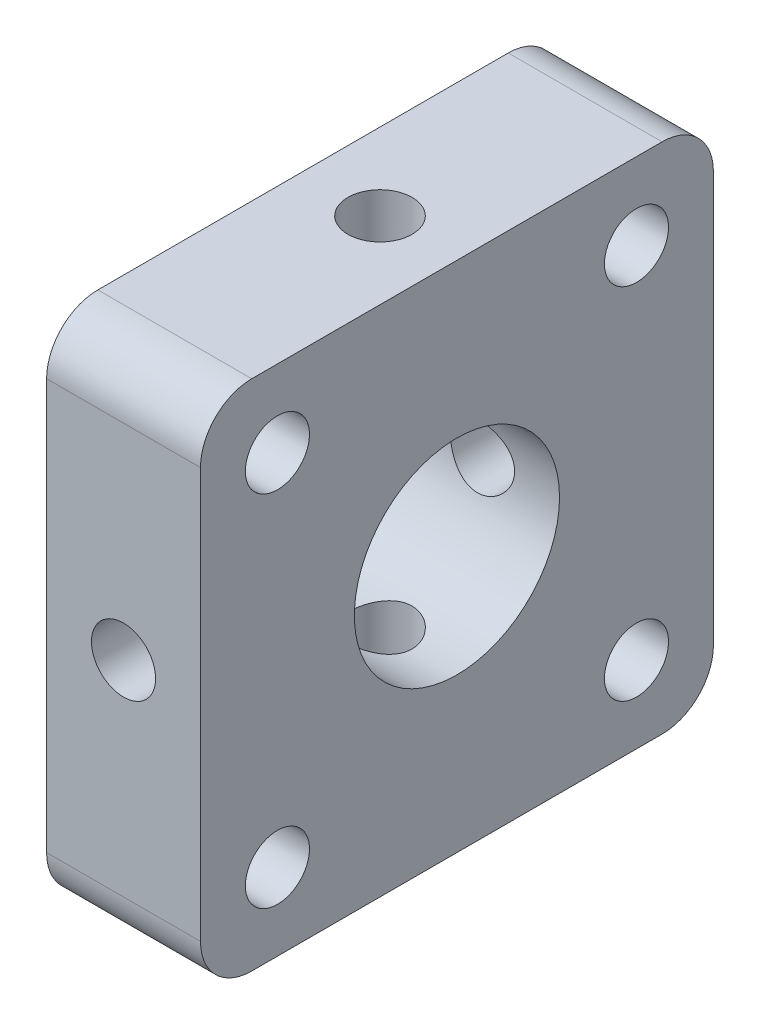
ISO-10303-21;
HEADER;
FILE_DESCRIPTION(('STEP AP214'),'2;1');
FILE_NAME('part.step','',(''),(''),'','','');
FILE_SCHEMA(('AUTOMOTIVE_DESIGN { 1 0 10303 214 1 1 1 1 }'));
ENDSEC;
DATA;
#1=APPLICATION_CONTEXT('core data for automotive mechanical design processes');
#2=APPLICATION_PROTOCOL_DEFINITION('international standard','automotive_design',2000,#1);
#3=PRODUCT_CONTEXT('',#1,'mechanical');
#4=PRODUCT('Part','Part','',(#3));
#5=PRODUCT_RELATED_PRODUCT_CATEGORY('part','',(#4));
#6=PRODUCT_DEFINITION_FORMATION('','',#4);
#7=PRODUCT_DEFINITION_CONTEXT('part definition',#1,'design');
#8=PRODUCT_DEFINITION('design','',#6,#7);
#9=PRODUCT_DEFINITION_SHAPE('','',#8);
#10=(LENGTH_UNIT() NAMED_UNIT(*) SI_UNIT(.MILLI.,.METRE.));
#11=(NAMED_UNIT(*) PLANE_ANGLE_UNIT() SI_UNIT($,.RADIAN.));
#12=(NAMED_UNIT(*) SI_UNIT($,.STERADIAN.) SOLID_ANGLE_UNIT());
#13=UNCERTAINTY_MEASURE_WITH_UNIT(LENGTH_MEASURE(1.E-05),#10,'distance_accuracy_value','');
#14=(GEOMETRIC_REPRESENTATION_CONTEXT(3) GLOBAL_UNCERTAINTY_ASSIGNED_CONTEXT((#13)) GLOBAL_UNIT_ASSIGNED_CONTEXT((#10,
#11,#12)) REPRESENTATION_CONTEXT('',''));
#15=CARTESIAN_POINT('',(0.,0.,0.));
#16=DIRECTION('',(0.,0.,1.));
#17=DIRECTION('',(1.,0.,0.));
#18=AXIS2_PLACEMENT_3D('',#15,#16,#17);
#19=CARTESIAN_POINT('',(0.,0.,0.));
#20=DIRECTION('',(1.,0.,0.));
#21=DIRECTION('',(0.,0.,-1.));
#22=AXIS2_PLACEMENT_3D('',#19,#20,#21);
#23=PLANE('',#22);
#24=CARTESIAN_POINT('',(0.,-7.00000000000001,7.));
#25=DIRECTION('',(-1.,0.,0.));
#26=DIRECTION('',(0.,0.,1.));
#27=AXIS2_PLACEMENT_3D('',#24,#25,#26);
#28=CIRCLE('',#27,1.24999999999999);
#29=CARTESIAN_POINT('',(0.,-7.00000000000001,8.24999999999999));
#30=VERTEX_POINT('',#29);
#31=EDGE_CURVE('E270',#30,#30,#28,.T.);
#32=ORIENTED_EDGE('',*,*,#31,.F.);
#33=EDGE_LOOP('',(#32));
#34=FACE_BOUND('',#33,.T.);
#35=DIRECTION('',(0.,0.,-1.));
#36=VECTOR('',#35,1.);
#37=CARTESIAN_POINT('',(0.,-10.,-10.));
#38=LINE('',#37,#36);
#39=CARTESIAN_POINT('',(0.,-10.,8.));
#40=VERTEX_POINT('',#39);
#41=CARTESIAN_POINT('',(0.,-10.,-8.));
#42=VERTEX_POINT('',#41);
#43=EDGE_CURVE('E128',#40,#42,#38,.T.);
#44=ORIENTED_EDGE('',*,*,#43,.F.);
#45=CARTESIAN_POINT('',(0.,-8.,8.));
#46=DIRECTION('',(1.,0.,0.));
#47=DIRECTION('',(0.,0.,-1.));
#48=AXIS2_PLACEMENT_3D('',#45,#46,#47);
#49=CIRCLE('',#48,2.);
#50=CARTESIAN_POINT('',(0.,-8.,10.));
#51=VERTEX_POINT('',#50);
#52=EDGE_CURVE('E110',#40,#51,#49,.F.);
#53=ORIENTED_EDGE('',*,*,#52,.T.);
#54=DIRECTION('',(0.,-1.,0.));
#55=VECTOR('',#54,1.);
#56=CARTESIAN_POINT('',(0.,-10.,10.));
#57=LINE('',#56,#55);
#58=CARTESIAN_POINT('',(0.,8.,10.));
#59=VERTEX_POINT('',#58);
#60=EDGE_CURVE('E140',#59,#51,#57,.T.);
#61=ORIENTED_EDGE('',*,*,#60,.F.);
#62=CARTESIAN_POINT('',(0.,8.,8.));
#63=DIRECTION('',(1.,0.,0.));
#64=DIRECTION('',(0.,0.,-1.));
#65=AXIS2_PLACEMENT_3D('',#62,#63,#64);
#66=CIRCLE('',#65,2.);
#67=CARTESIAN_POINT('',(0.,10.,8.));
#68=VERTEX_POINT('',#67);
#69=EDGE_CURVE('E203',#59,#68,#66,.F.);
#70=ORIENTED_EDGE('',*,*,#69,.T.);
#71=DIRECTION('',(0.,0.,1.));
#72=VECTOR('',#71,1.);
#73=CARTESIAN_POINT('',(0.,10.,-10.));
#74=LINE('',#73,#72);
#75=CARTESIAN_POINT('',(0.,10.,-8.));
#76=VERTEX_POINT('',#75);
#77=EDGE_CURVE('E145',#76,#68,#74,.T.);
#78=ORIENTED_EDGE('',*,*,#77,.F.);
#79=CARTESIAN_POINT('',(0.,8.,-8.));
#80=DIRECTION('',(1.,0.,0.));
#81=DIRECTION('',(0.,0.,-1.));
#82=AXIS2_PLACEMENT_3D('',#79,#80,#81);
#83=CIRCLE('',#82,2.);
#84=CARTESIAN_POINT('',(0.,8.,-10.));
#85=VERTEX_POINT('',#84);
#86=EDGE_CURVE('E133',#76,#85,#83,.F.);
#87=ORIENTED_EDGE('',*,*,#86,.T.);
#88=DIRECTION('',(0.,1.,0.));
#89=VECTOR('',#88,1.);
#90=CARTESIAN_POINT('',(0.,-10.,-10.));
#91=LINE('',#90,#89);
#92=CARTESIAN_POINT('',(0.,-8.,-10.));
#93=VERTEX_POINT('',#92);
#94=EDGE_CURVE('E139',#93,#85,#91,.T.);
#95=ORIENTED_EDGE('',*,*,#94,.F.);
#96=CARTESIAN_POINT('',(0.,-8.,-8.));
#97=DIRECTION('',(1.,0.,0.));
#98=DIRECTION('',(0.,0.,-1.));
#99=AXIS2_PLACEMENT_3D('',#96,#97,#98);
#100=CIRCLE('',#99,2.);
#101=EDGE_CURVE('E122',#93,#42,#100,.F.);
#102=ORIENTED_EDGE('',*,*,#101,.T.);
#103=EDGE_LOOP('',(#44,#53,#61,#70,#78,#87,#95,#102));
#104=FACE_BOUND('',#103,.T.);
#105=CARTESIAN_POINT('',(0.,0.,0.));
#106=DIRECTION('',(1.,0.,0.));
#107=DIRECTION('',(0.,0.,-1.));
#108=AXIS2_PLACEMENT_3D('',#105,#106,#107);
#109=CIRCLE('',#108,4.);
#110=CARTESIAN_POINT('',(0.,0.,-4.));
#111=VERTEX_POINT('',#110);
#112=EDGE_CURVE('E252',#111,#111,#109,.T.);
#113=ORIENTED_EDGE('',*,*,#112,.T.);
#114=EDGE_LOOP('',(#113));
#115=FACE_BOUND('',#114,.T.);
#116=CARTESIAN_POINT('',(0.,-7.,-7.));
#117=DIRECTION('',(-1.,0.,0.));
#118=DIRECTION('',(0.,0.,1.));
#119=AXIS2_PLACEMENT_3D('',#116,#117,#118);
#120=CIRCLE('',#119,1.24999999999999);
#121=CARTESIAN_POINT('',(0.,-7.,-5.75000000000001));
#122=VERTEX_POINT('',#121);
#123=EDGE_CURVE('E554',#122,#122,#120,.T.);
#124=ORIENTED_EDGE('',*,*,#123,.F.);
#125=EDGE_LOOP('',(#124));
#126=FACE_BOUND('',#125,.T.);
#127=CARTESIAN_POINT('',(0.,7.,7.));
#128=DIRECTION('',(-1.,0.,0.));
#129=DIRECTION('',(0.,0.,1.));
#130=AXIS2_PLACEMENT_3D('',#127,#128,#129);
#131=CIRCLE('',#130,1.24999999999999);
#132=CARTESIAN_POINT('',(0.,7.,8.24999999999999));
#133=VERTEX_POINT('',#132);
#134=EDGE_CURVE('E546',#133,#133,#131,.T.);
#135=ORIENTED_EDGE('',*,*,#134,.F.);
#136=EDGE_LOOP('',(#135));
#137=FACE_BOUND('',#136,.T.);
#138=CARTESIAN_POINT('',(0.,7.,-7.));
#139=DIRECTION('',(-1.,0.,0.));
#140=DIRECTION('',(0.,0.,1.));
#141=AXIS2_PLACEMENT_3D('',#138,#139,#140);
#142=CIRCLE('',#141,1.24999999999999);
#143=CARTESIAN_POINT('',(0.,7.,-5.75000000000001));
#144=VERTEX_POINT('',#143);
#145=EDGE_CURVE('E541',#144,#144,#142,.T.);
#146=ORIENTED_EDGE('',*,*,#145,.F.);
#147=EDGE_LOOP('',(#146));
#148=FACE_BOUND('',#147,.T.);
#149=ADVANCED_FACE('F44',(#34,#104,#115,#126,#137,#148),#23,.F.);
#150=CARTESIAN_POINT('',(6.,0.,0.));
#151=DIRECTION('',(1.,0.,0.));
#152=DIRECTION('',(0.,0.,-1.));
#153=AXIS2_PLACEMENT_3D('',#150,#151,#152);
#154=PLANE('',#153);
#155=CARTESIAN_POINT('',(6.,7.,-7.));
#156=DIRECTION('',(-1.,0.,0.));
#157=DIRECTION('',(0.,0.,1.));
#158=AXIS2_PLACEMENT_3D('',#155,#156,#157);
#159=CIRCLE('',#158,1.25);
#160=CARTESIAN_POINT('',(6.,7.,-5.75));
#161=VERTEX_POINT('',#160);
#162=EDGE_CURVE('E538',#161,#161,#159,.T.);
#163=ORIENTED_EDGE('',*,*,#162,.T.);
#164=EDGE_LOOP('',(#163));
#165=FACE_BOUND('',#164,.T.);
#166=CARTESIAN_POINT('',(6.,7.,7.));
#167=DIRECTION('',(-1.,0.,0.));
#168=DIRECTION('',(0.,0.,1.));
#169=AXIS2_PLACEMENT_3D('',#166,#167,#168);
#170=CIRCLE('',#169,1.25);
#171=CARTESIAN_POINT('',(6.,7.,8.25));
#172=VERTEX_POINT('',#171);
#173=EDGE_CURVE('E551',#172,#172,#170,.T.);
#174=ORIENTED_EDGE('',*,*,#173,.T.);
#175=EDGE_LOOP('',(#174));
#176=FACE_BOUND('',#175,.T.);
#177=CARTESIAN_POINT('',(6.,-7.,-7.));
#178=DIRECTION('',(-1.,0.,0.));
#179=DIRECTION('',(0.,0.,1.));
#180=AXIS2_PLACEMENT_3D('',#177,#178,#179);
#181=CIRCLE('',#180,1.25);
#182=CARTESIAN_POINT('',(6.,-7.,-5.75));
#183=VERTEX_POINT('',#182);
#184=EDGE_CURVE('E278',#183,#183,#181,.T.);
#185=ORIENTED_EDGE('',*,*,#184,.T.);
#186=EDGE_LOOP('',(#185));
#187=FACE_BOUND('',#186,.T.);
#188=CARTESIAN_POINT('',(6.,0.,0.));
#189=DIRECTION('',(1.,0.,0.));
#190=DIRECTION('',(0.,0.,-1.));
#191=AXIS2_PLACEMENT_3D('',#188,#189,#190);
#192=CIRCLE('',#191,4.);
#193=CARTESIAN_POINT('',(6.,0.,-4.));
#194=VERTEX_POINT('',#193);
#195=EDGE_CURVE('E148',#194,#194,#192,.T.);
#196=ORIENTED_EDGE('',*,*,#195,.F.);
#197=EDGE_LOOP('',(#196));
#198=FACE_BOUND('',#197,.T.);
#199=DIRECTION('',(0.,-1.,0.));
#200=VECTOR('',#199,1.);
#201=CARTESIAN_POINT('',(6.,-10.,10.));
#202=LINE('',#201,#200);
#203=CARTESIAN_POINT('',(6.,8.,10.));
#204=VERTEX_POINT('',#203);
#205=CARTESIAN_POINT('',(6.,-8.,10.));
#206=VERTEX_POINT('',#205);
#207=EDGE_CURVE('E154',#204,#206,#202,.T.);
#208=ORIENTED_EDGE('',*,*,#207,.T.);
#209=CARTESIAN_POINT('',(6.,-8.,8.));
#210=DIRECTION('',(1.,0.,0.));
#211=DIRECTION('',(0.,0.,-1.));
#212=AXIS2_PLACEMENT_3D('',#209,#210,#211);
#213=CIRCLE('',#212,2.);
#214=CARTESIAN_POINT('',(6.,-10.,8.));
#215=VERTEX_POINT('',#214);
#216=EDGE_CURVE('E221',#206,#215,#213,.T.);
#217=ORIENTED_EDGE('',*,*,#216,.T.);
#218=DIRECTION('',(0.,0.,-1.));
#219=VECTOR('',#218,1.);
#220=CARTESIAN_POINT('',(6.,-10.,-10.));
#221=LINE('',#220,#219);
#222=CARTESIAN_POINT('',(6.,-10.,-8.));
#223=VERTEX_POINT('',#222);
#224=EDGE_CURVE('E131',#215,#223,#221,.T.);
#225=ORIENTED_EDGE('',*,*,#224,.T.);
#226=CARTESIAN_POINT('',(6.,-8.,-8.));
#227=DIRECTION('',(1.,0.,0.));
#228=DIRECTION('',(0.,0.,-1.));
#229=AXIS2_PLACEMENT_3D('',#226,#227,#228);
#230=CIRCLE('',#229,2.);
#231=CARTESIAN_POINT('',(6.,-8.,-10.));
#232=VERTEX_POINT('',#231);
#233=EDGE_CURVE('E218',#223,#232,#230,.T.);
#234=ORIENTED_EDGE('',*,*,#233,.T.);
#235=DIRECTION('',(0.,1.,0.));
#236=VECTOR('',#235,1.);
#237=CARTESIAN_POINT('',(6.,-10.,-10.));
#238=LINE('',#237,#236);
#239=CARTESIAN_POINT('',(6.,8.,-10.));
#240=VERTEX_POINT('',#239);
#241=EDGE_CURVE('E249',#232,#240,#238,.T.);
#242=ORIENTED_EDGE('',*,*,#241,.T.);
#243=CARTESIAN_POINT('',(6.,8.,-8.));
#244=DIRECTION('',(1.,0.,0.));
#245=DIRECTION('',(0.,0.,-1.));
#246=AXIS2_PLACEMENT_3D('',#243,#244,#245);
#247=CIRCLE('',#246,2.);
#248=CARTESIAN_POINT('',(6.,10.,-8.));
#249=VERTEX_POINT('',#248);
#250=EDGE_CURVE('E65',#240,#249,#247,.T.);
#251=ORIENTED_EDGE('',*,*,#250,.T.);
#252=DIRECTION('',(0.,0.,1.));
#253=VECTOR('',#252,1.);
#254=CARTESIAN_POINT('',(6.,10.,-10.));
#255=LINE('',#254,#253);
#256=CARTESIAN_POINT('',(6.,10.,8.));
#257=VERTEX_POINT('',#256);
#258=EDGE_CURVE('E199',#249,#257,#255,.T.);
#259=ORIENTED_EDGE('',*,*,#258,.T.);
#260=CARTESIAN_POINT('',(6.,8.,8.));
#261=DIRECTION('',(1.,0.,0.));
#262=DIRECTION('',(0.,0.,-1.));
#263=AXIS2_PLACEMENT_3D('',#260,#261,#262);
#264=CIRCLE('',#263,2.);
#265=EDGE_CURVE('E215',#257,#204,#264,.T.);
#266=ORIENTED_EDGE('',*,*,#265,.T.);
#267=EDGE_LOOP('',(#208,#217,#225,#234,#242,#251,#259,#266));
#268=FACE_BOUND('',#267,.T.);
#269=CARTESIAN_POINT('',(6.,-7.00000000000001,7.));
#270=DIRECTION('',(-1.,0.,0.));
#271=DIRECTION('',(0.,0.,1.));
#272=AXIS2_PLACEMENT_3D('',#269,#270,#271);
#273=CIRCLE('',#272,1.25);
#274=CARTESIAN_POINT('',(6.,-7.00000000000001,8.25));
#275=VERTEX_POINT('',#274);
#276=EDGE_CURVE('E266',#275,#275,#273,.T.);
#277=ORIENTED_EDGE('',*,*,#276,.T.);
#278=EDGE_LOOP('',(#277));
#279=FACE_BOUND('',#278,.T.);
#280=ADVANCED_FACE('F260',(#165,#176,#187,#198,#268,#279),#154,.T.);
#281=CARTESIAN_POINT('',(6.,-10.,10.));
#282=DIRECTION('',(0.,0.,-1.));
#283=DIRECTION('',(-1.,0.,0.));
#284=AXIS2_PLACEMENT_3D('',#281,#282,#283);
#285=PLANE('',#284);
#286=CARTESIAN_POINT('',(3.,0.,10.));
#287=DIRECTION('',(0.,0.,-1.));
#288=DIRECTION('',(-1.,0.,0.));
#289=AXIS2_PLACEMENT_3D('',#286,#287,#288);
#290=CIRCLE('',#289,1.25);
#291=CARTESIAN_POINT('',(1.75000000000001,0.,10.));
#292=VERTEX_POINT('',#291);
#293=EDGE_CURVE('E274',#292,#292,#290,.T.);
#294=ORIENTED_EDGE('',*,*,#293,.T.);
#295=EDGE_LOOP('',(#294));
#296=FACE_BOUND('',#295,.T.);
#297=ORIENTED_EDGE('',*,*,#60,.T.);
#298=DIRECTION('',(-1.,0.,0.));
#299=VECTOR('',#298,1.);
#300=CARTESIAN_POINT('',(6.,-8.,10.));
#301=LINE('',#300,#299);
#302=EDGE_CURVE('E115',#51,#206,#301,.F.);
#303=ORIENTED_EDGE('',*,*,#302,.T.);
#304=ORIENTED_EDGE('',*,*,#207,.F.);
#305=DIRECTION('',(-1.,0.,0.));
#306=VECTOR('',#305,1.);
#307=CARTESIAN_POINT('',(6.,8.,10.));
#308=LINE('',#307,#306);
#309=EDGE_CURVE('E121',#204,#59,#308,.T.);
#310=ORIENTED_EDGE('',*,*,#309,.T.);
#311=EDGE_LOOP('',(#297,#303,#304,#310));
#312=FACE_BOUND('',#311,.T.);
#313=ADVANCED_FACE('F242',(#296,#312),#285,.F.);
#314=CARTESIAN_POINT('',(6.,-10.,-10.));
#315=DIRECTION('',(0.,1.,0.));
#316=DIRECTION('',(0.,0.,1.));
#317=AXIS2_PLACEMENT_3D('',#314,#315,#316);
#318=PLANE('',#317);
#319=CARTESIAN_POINT('',(3.,-10.,0.));
#320=DIRECTION('',(0.,1.,0.));
#321=DIRECTION('',(0.,0.,1.));
#322=AXIS2_PLACEMENT_3D('',#319,#320,#321);
#323=CIRCLE('',#322,1.25);
#324=CARTESIAN_POINT('',(3.,-10.,1.25));
#325=VERTEX_POINT('',#324);
#326=EDGE_CURVE('E164',#325,#325,#323,.T.);
#327=ORIENTED_EDGE('',*,*,#326,.T.);
#328=EDGE_LOOP('',(#327));
#329=FACE_BOUND('',#328,.T.);
#330=ORIENTED_EDGE('',*,*,#224,.F.);
#331=DIRECTION('',(-1.,0.,0.));
#332=VECTOR('',#331,1.);
#333=CARTESIAN_POINT('',(6.,-10.,8.));
#334=LINE('',#333,#332);
#335=EDGE_CURVE('E114',#215,#40,#334,.T.);
#336=ORIENTED_EDGE('',*,*,#335,.T.);
#337=ORIENTED_EDGE('',*,*,#43,.T.);
#338=DIRECTION('',(-1.,0.,0.));
#339=VECTOR('',#338,1.);
#340=CARTESIAN_POINT('',(6.,-10.,-8.));
#341=LINE('',#340,#339);
#342=EDGE_CURVE('E134',#42,#223,#341,.F.);
#343=ORIENTED_EDGE('',*,*,#342,.T.);
#344=EDGE_LOOP('',(#330,#336,#337,#343));
#345=FACE_BOUND('',#344,.T.);
#346=ADVANCED_FACE('F127',(#329,#345),#318,.F.);
#347=CARTESIAN_POINT('',(6.,-10.,-10.));
#348=DIRECTION('',(0.,0.,1.));
#349=DIRECTION('',(0.,-1.,0.));
#350=AXIS2_PLACEMENT_3D('',#347,#348,#349);
#351=PLANE('',#350);
#352=CARTESIAN_POINT('',(3.,0.,-10.));
#353=DIRECTION('',(0.,0.,-1.));
#354=DIRECTION('',(-1.,0.,0.));
#355=AXIS2_PLACEMENT_3D('',#352,#353,#354);
#356=CIRCLE('',#355,1.24999999999999);
#357=CARTESIAN_POINT('',(1.75000000000001,0.,-10.));
#358=VERTEX_POINT('',#357);
#359=EDGE_CURVE('E269',#358,#358,#356,.T.);
#360=ORIENTED_EDGE('',*,*,#359,.F.);
#361=EDGE_LOOP('',(#360));
#362=FACE_BOUND('',#361,.T.);
#363=ORIENTED_EDGE('',*,*,#241,.F.);
#364=DIRECTION('',(-1.,0.,0.));
#365=VECTOR('',#364,1.);
#366=CARTESIAN_POINT('',(6.,-8.,-10.));
#367=LINE('',#366,#365);
#368=EDGE_CURVE('E227',#232,#93,#367,.T.);
#369=ORIENTED_EDGE('',*,*,#368,.T.);
#370=ORIENTED_EDGE('',*,*,#94,.T.);
#371=DIRECTION('',(-1.,0.,0.));
#372=VECTOR('',#371,1.);
#373=CARTESIAN_POINT('',(6.,8.,-10.));
#374=LINE('',#373,#372);
#375=EDGE_CURVE('E224',#85,#240,#374,.F.);
#376=ORIENTED_EDGE('',*,*,#375,.T.);
#377=EDGE_LOOP('',(#363,#369,#370,#376));
#378=FACE_BOUND('',#377,.T.);
#379=ADVANCED_FACE('F314',(#362,#378),#351,.F.);
#380=CARTESIAN_POINT('',(6.,10.,-10.));
#381=DIRECTION('',(0.,-1.,0.));
#382=DIRECTION('',(0.,0.,-1.));
#383=AXIS2_PLACEMENT_3D('',#380,#381,#382);
#384=PLANE('',#383);
#385=CARTESIAN_POINT('',(3.,10.,0.));
#386=DIRECTION('',(0.,1.,0.));
#387=DIRECTION('',(0.,0.,1.));
#388=AXIS2_PLACEMENT_3D('',#385,#386,#387);
#389=CIRCLE('',#388,1.24999999999999);
#390=CARTESIAN_POINT('',(3.,10.,1.24999999999999));
#391=VERTEX_POINT('',#390);
#392=EDGE_CURVE('E197',#391,#391,#389,.T.);
#393=ORIENTED_EDGE('',*,*,#392,.F.);
#394=EDGE_LOOP('',(#393));
#395=FACE_BOUND('',#394,.T.);
#396=ORIENTED_EDGE('',*,*,#77,.T.);
#397=DIRECTION('',(-1.,0.,0.));
#398=VECTOR('',#397,1.);
#399=CARTESIAN_POINT('',(6.,10.,8.));
#400=LINE('',#399,#398);
#401=EDGE_CURVE('E11',#68,#257,#400,.F.);
#402=ORIENTED_EDGE('',*,*,#401,.T.);
#403=ORIENTED_EDGE('',*,*,#258,.F.);
#404=DIRECTION('',(-1.,0.,0.));
#405=VECTOR('',#404,1.);
#406=CARTESIAN_POINT('',(6.,10.,-8.));
#407=LINE('',#406,#405);
#408=EDGE_CURVE('E53',#249,#76,#407,.T.);
#409=ORIENTED_EDGE('',*,*,#408,.T.);
#410=EDGE_LOOP('',(#396,#402,#403,#409));
#411=FACE_BOUND('',#410,.T.);
#412=ADVANCED_FACE('F234',(#395,#411),#384,.F.);
#413=CARTESIAN_POINT('',(6.,0.,0.));
#414=DIRECTION('',(-1.,0.,0.));
#415=DIRECTION('',(0.,0.,1.));
#416=AXIS2_PLACEMENT_3D('',#413,#414,#415);
#417=CYLINDRICAL_SURFACE('',#416,4.);
#418=CARTESIAN_POINT('',(4.24999999999999,0.,4.));
#419=CARTESIAN_POINT('',(4.24999955341242,-0.068439185174546,3.99999965877989));
#420=CARTESIAN_POINT('',(4.24436077305554,-0.136883052502858,3.99822694984841));
#421=CARTESIAN_POINT('',(4.22201375846076,-0.271769209588447,3.99132894088807));
#422=CARTESIAN_POINT('',(4.20530301863563,-0.338211042725905,3.98620288199859));
#423=CARTESIAN_POINT('',(4.16143062880426,-0.467128543650803,3.97315815697909));
#424=CARTESIAN_POINT('',(4.13428515534703,-0.5296101769858,3.96524381499025));
#425=CARTESIAN_POINT('',(4.07038268232166,-0.649134802346456,3.94743969161093));
#426=CARTESIAN_POINT('',(4.03362416821941,-0.70617693544488,3.93754959899905));
#427=CARTESIAN_POINT('',(3.95034400798263,-0.814965334952276,3.91650213740282));
#428=CARTESIAN_POINT('',(3.90357911493892,-0.866520028156654,3.90531715926989));
#429=CARTESIAN_POINT('',(3.80213160758644,-0.961197382036988,3.88310046374208));
#430=CARTESIAN_POINT('',(3.74744752250545,-1.00431847289869,3.87206877523457));
#431=CARTESIAN_POINT('',(3.63005543619191,-1.08194336483113,3.85111144698172));
#432=CARTESIAN_POINT('',(3.56718252247277,-1.11620784150128,3.84121988301796));
#433=CARTESIAN_POINT('',(3.43620768501812,-1.17359741076671,3.82407801799234));
#434=CARTESIAN_POINT('',(3.36810714420607,-1.19672543771944,3.81682702128689));
#435=CARTESIAN_POINT('',(3.23077192254794,-1.23048459930033,3.80607606984501));
#436=CARTESIAN_POINT('',(3.16163315636115,-1.24147110007864,3.80246972929508));
#437=CARTESIAN_POINT('',(3.02240688108811,-1.25174555036987,3.7991005514095));
#438=CARTESIAN_POINT('',(2.95231962917834,-1.25103660995771,3.79933669227334));
#439=CARTESIAN_POINT('',(2.81612553973102,-1.23821824732738,3.80353189075438));
#440=CARTESIAN_POINT('',(2.74997087413844,-1.22656057869382,3.80734341745949));
#441=CARTESIAN_POINT('',(2.62060784346266,-1.19290813355625,3.81802025652489));
#442=CARTESIAN_POINT('',(2.5573997922912,-1.1709122584455,3.82488589343115));
#443=CARTESIAN_POINT('',(2.43464805556737,-1.11688874681277,3.84101044014297));
#444=CARTESIAN_POINT('',(2.37517138930802,-1.08471925662081,3.85030284660824));
#445=CARTESIAN_POINT('',(2.26231223212088,-1.01136020737847,3.8702185658007));
#446=CARTESIAN_POINT('',(2.20893132974629,-0.970168305215766,3.88084222394551));
#447=CARTESIAN_POINT('',(2.10722505658302,-0.877716954182118,3.90281527800493));
#448=CARTESIAN_POINT('',(2.05924044222032,-0.826084570592812,3.91417569605696));
#449=CARTESIAN_POINT('',(1.97252810642033,-0.715364408095526,3.9359157075958));
#450=CARTESIAN_POINT('',(1.9338010707808,-0.656276077349016,3.94629522838372));
#451=CARTESIAN_POINT('',(1.86647231139873,-0.531664610465451,3.96501294890191));
#452=CARTESIAN_POINT('',(1.83795186453604,-0.466094906919277,3.97333460648208));
#453=CARTESIAN_POINT('',(1.79244699914844,-0.330767977782642,3.98687955828554));
#454=CARTESIAN_POINT('',(1.77545907776161,-0.261012030724607,3.99210379325151));
#455=CARTESIAN_POINT('',(1.75408195742103,-0.122185157290344,3.99871389395014));
#456=CARTESIAN_POINT('',(1.74923145640649,-0.0531918487888419,4.00024022895439));
#457=CARTESIAN_POINT('',(1.75096622663734,0.0846303057325843,3.99969799730981));
#458=CARTESIAN_POINT('',(1.75754982732261,0.153459174306504,3.99762995581124));
#459=CARTESIAN_POINT('',(1.7815955926064,0.28721933297585,3.99022363769771));
#460=CARTESIAN_POINT('',(1.79878326761252,0.352204978420945,3.98496793110724));
#461=CARTESIAN_POINT('',(1.8432143523667,0.478351928861362,3.97180121379252));
#462=CARTESIAN_POINT('',(1.87045900402491,0.539512760449012,3.96388987514203));
#463=CARTESIAN_POINT('',(1.9349732165488,0.657932406672227,3.94598542759568));
#464=CARTESIAN_POINT('',(1.97247098749723,0.71505973978795,3.9359462681821));
#465=CARTESIAN_POINT('',(2.05615321011702,0.822365850960089,3.91493410002887));
#466=CARTESIAN_POINT('',(2.10234001774312,0.87254273804333,3.90396083845862));
#467=CARTESIAN_POINT('',(2.20425889005369,0.96658746291965,3.88176994885247));
#468=CARTESIAN_POINT('',(2.26029666374526,1.01012652339773,3.87055986714446));
#469=CARTESIAN_POINT('',(2.37912661637074,1.08721250244908,3.84961947087602));
#470=CARTESIAN_POINT('',(2.44191868800444,1.12075957972523,3.839889132814));
#471=CARTESIAN_POINT('',(2.57234517288586,1.1767008348114,3.82311782360754));
#472=CARTESIAN_POINT('',(2.6399596495047,1.19913819558885,3.81606646468027));
#473=CARTESIAN_POINT('',(2.7782724933238,1.23222894320963,3.80551170941212));
#474=CARTESIAN_POINT('',(2.84896967637132,1.24288681414609,3.80200696302675));
#475=CARTESIAN_POINT('',(2.98800408755424,1.25179406157539,3.79908292712495));
#476=CARTESIAN_POINT('',(3.05630345381293,1.25058279621956,3.79948604683077));
#477=CARTESIAN_POINT('',(3.19167458491918,1.23708818129473,3.80390090472383));
#478=CARTESIAN_POINT('',(3.258746406884,1.22480534822558,3.80791247457319));
#479=CARTESIAN_POINT('',(3.38879403960178,1.18987729913377,3.81896814158112));
#480=CARTESIAN_POINT('',(3.45181544109601,1.16738642405943,3.82596698183474));
#481=CARTESIAN_POINT('',(3.57324041353135,1.11280227335063,3.84219704261348));
#482=CARTESIAN_POINT('',(3.63164304207768,1.08070704444253,3.85142871716522));
#483=CARTESIAN_POINT('',(3.74464597044056,1.00635675013474,3.8715348703158));
#484=CARTESIAN_POINT('',(3.79900812950044,0.963753335241265,3.88245948922441));
#485=CARTESIAN_POINT('',(3.89998632811179,0.87020899640484,3.90448998821726));
#486=CARTESIAN_POINT('',(3.946600288991,0.819265842344395,3.91559591606795));
#487=CARTESIAN_POINT('',(4.03228253836298,0.708486662823325,3.93717271952329));
#488=CARTESIAN_POINT('',(4.07105473644996,0.648414574487373,3.94761101730634));
#489=CARTESIAN_POINT('',(4.13789891513943,0.522279138013647,3.96626769296916));
#490=CARTESIAN_POINT('',(4.16597510214182,0.456218157795443,3.97448694315832));
#491=CARTESIAN_POINT('',(4.20859136760846,0.325747635373973,3.98720650733461));
#492=CARTESIAN_POINT('',(4.22407486730533,0.261670337112542,3.99196240806139));
#493=CARTESIAN_POINT('',(4.24477835996771,0.131729895440246,3.99835900340486));
#494=CARTESIAN_POINT('',(4.25000042980399,0.0658671161396739,4.00000032839644));
#495=CARTESIAN_POINT('',(4.24999999999999,0.,4.));
#496=B_SPLINE_CURVE_WITH_KNOTS('',3,(#418,#419,#420,#421,#422,#423,#424,#425,#426,#427,#428,
#429,#430,#431,#432,#433,#434,#435,#436,#437,#438,#439,#440,#441,#442,#443,#444,#445,#446,#447,
#448,#449,#450,#451,#452,#453,#454,#455,#456,#457,#458,#459,#460,#461,#462,#463,#464,#465,#466,
#467,#468,#469,#470,#471,#472,#473,#474,#475,#476,#477,#478,#479,#480,#481,#482,#483,#484,#485,
#486,#487,#488,#489,#490,#491,#492,#493,#494,#495),.UNSPECIFIED.,.T.,.F.,(4,2,2,2,2,2,2,2,2,2,2,
2,2,2,2,2,2,2,2,2,2,2,2,2,2,2,2,2,2,2,2,2,2,2,2,2,2,2,4),(0.,0.205075449432509,
0.410197323349064,0.615002479202432,0.819839921558386,1.03037822195158,1.24095567431275,
1.45673771247493,1.67246286279526,1.88169150167209,2.09086450295137,2.29176917422168,
2.49269519979061,2.69655642720543,2.90047066010357,3.11366747279598,3.32688007413301,
3.54175460689768,3.75656384494551,3.96307568548235,4.1695573564936,4.37090626722869,
4.57228005034497,4.7785632473834,4.98490245709256,5.19941778713136,5.41392970983709,
5.62760115751027,5.84119123892427,6.0451220347605,6.24904331751081,6.44997913396667,
6.65095584330169,6.85979514006357,7.06869037373336,7.28440668126408,7.50003806666332,
7.69744636651536,7.89481470763042),.UNSPECIFIED.);
#497=CARTESIAN_POINT('',(4.24999999999999,0.,4.));
#498=VERTEX_POINT('',#497);
#499=EDGE_CURVE('E191',#498,#498,#496,.T.);
#500=ORIENTED_EDGE('',*,*,#499,.F.);
#501=EDGE_LOOP('',(#500));
#502=FACE_BOUND('',#501,.T.);
#503=CARTESIAN_POINT('',(1.75000000000001,0.,-4.));
#504=CARTESIAN_POINT('',(1.75000044658758,-0.0684391851745469,-3.99999965877989));
#505=CARTESIAN_POINT('',(1.75563922694446,-0.136883052502859,-3.99822694984841));
#506=CARTESIAN_POINT('',(1.77798624153924,-0.271769209588447,-3.99132894088807));
#507=CARTESIAN_POINT('',(1.79469698136437,-0.338211042725906,-3.9862028819986));
#508=CARTESIAN_POINT('',(1.83856937119575,-0.467128543650804,-3.9731581569791));
#509=CARTESIAN_POINT('',(1.86571484465297,-0.529610176985801,-3.96524381499025));
#510=CARTESIAN_POINT('',(1.92961731767834,-0.649134802346456,-3.94743969161093));
#511=CARTESIAN_POINT('',(1.96637583178059,-0.706176935444881,-3.93754959899905));
#512=CARTESIAN_POINT('',(2.04965599201737,-0.814965334952276,-3.91650213740283));
#513=CARTESIAN_POINT('',(2.09642088506108,-0.866520028156655,-3.90531715926989));
#514=CARTESIAN_POINT('',(2.19786839241356,-0.961197382036988,-3.88310046374209));
#515=CARTESIAN_POINT('',(2.25255247749455,-1.00431847289869,-3.87206877523458));
#516=CARTESIAN_POINT('',(2.36994456380809,-1.08194336483113,-3.85111144698173));
#517=CARTESIAN_POINT('',(2.43281747752723,-1.11620784150128,-3.84121988301796));
#518=CARTESIAN_POINT('',(2.56379231498188,-1.17359741076671,-3.82407801799235));
#519=CARTESIAN_POINT('',(2.63189285579393,-1.19672543771944,-3.81682702128689));
#520=CARTESIAN_POINT('',(2.76922807745206,-1.23048459930033,-3.80607606984501));
#521=CARTESIAN_POINT('',(2.83836684363885,-1.24147110007864,-3.80246972929509));
#522=CARTESIAN_POINT('',(2.97759311891189,-1.25174555036987,-3.79910055140951));
#523=CARTESIAN_POINT('',(3.04768037082166,-1.25103660995771,-3.79933669227335));
#524=CARTESIAN_POINT('',(3.18387446026898,-1.23821824732738,-3.80353189075438));
#525=CARTESIAN_POINT('',(3.25002912586156,-1.22656057869382,-3.80734341745949));
#526=CARTESIAN_POINT('',(3.37939215653734,-1.19290813355625,-3.81802025652489));
#527=CARTESIAN_POINT('',(3.4426002077088,-1.1709122584455,-3.82488589343115));
#528=CARTESIAN_POINT('',(3.56535194443263,-1.11688874681276,-3.84101044014297));
#529=CARTESIAN_POINT('',(3.62482861069198,-1.08471925662081,-3.85030284660825));
#530=CARTESIAN_POINT('',(3.73768776787912,-1.01136020737847,-3.8702185658007));
#531=CARTESIAN_POINT('',(3.79106867025371,-0.970168305215766,-3.88084222394551));
#532=CARTESIAN_POINT('',(3.89277494341698,-0.877716954182117,-3.90281527800493));
#533=CARTESIAN_POINT('',(3.94075955777968,-0.826084570592811,-3.91417569605696));
#534=CARTESIAN_POINT('',(4.02747189357967,-0.715364408095526,-3.9359157075958));
#535=CARTESIAN_POINT('',(4.0661989292192,-0.656276077349016,-3.94629522838373));
#536=CARTESIAN_POINT('',(4.13352768860127,-0.53166461046545,-3.96501294890191));
#537=CARTESIAN_POINT('',(4.16204813546396,-0.466094906919276,-3.97333460648208));
#538=CARTESIAN_POINT('',(4.20755300085156,-0.330767977782641,-3.98687955828554));
#539=CARTESIAN_POINT('',(4.22454092223839,-0.261012030724606,-3.99210379325152));
#540=CARTESIAN_POINT('',(4.24591804257897,-0.122185157290343,-3.99871389395014));
#541=CARTESIAN_POINT('',(4.25076854359351,-0.0531918487888414,-4.00024022895439));
#542=CARTESIAN_POINT('',(4.24903377336266,0.0846303057325847,-3.99969799730981));
#543=CARTESIAN_POINT('',(4.24245017267739,0.153459174306505,-3.99762995581125));
#544=CARTESIAN_POINT('',(4.2184044073936,0.287219332975851,-3.99022363769772));
#545=CARTESIAN_POINT('',(4.20121673238747,0.352204978420946,-3.98496793110725));
#546=CARTESIAN_POINT('',(4.1567856476333,0.478351928861363,-3.97180121379252));
#547=CARTESIAN_POINT('',(4.12954099597509,0.539512760449013,-3.96388987514204));
#548=CARTESIAN_POINT('',(4.0650267834512,0.657932406672228,-3.94598542759568));
#549=CARTESIAN_POINT('',(4.02752901250277,0.715059739787951,-3.9359462681821));
#550=CARTESIAN_POINT('',(3.94384678988298,0.822365850960091,-3.91493410002887));
#551=CARTESIAN_POINT('',(3.89765998225688,0.872542738043331,-3.90396083845862));
#552=CARTESIAN_POINT('',(3.79574110994631,0.96658746291965,-3.88176994885248));
#553=CARTESIAN_POINT('',(3.73970333625474,1.01012652339773,-3.87055986714446));
#554=CARTESIAN_POINT('',(3.62087338362926,1.08721250244908,-3.84961947087602));
#555=CARTESIAN_POINT('',(3.55808131199556,1.12075957972523,-3.839889132814));
#556=CARTESIAN_POINT('',(3.42765482711414,1.1767008348114,-3.82311782360754));
#557=CARTESIAN_POINT('',(3.3600403504953,1.19913819558885,-3.81606646468027));
#558=CARTESIAN_POINT('',(3.2217275066762,1.23222894320963,-3.80551170941213));
#559=CARTESIAN_POINT('',(3.15103032362868,1.24288681414609,-3.80200696302675));
#560=CARTESIAN_POINT('',(3.01199591244576,1.25179406157539,-3.79908292712495));
#561=CARTESIAN_POINT('',(2.94369654618707,1.25058279621956,-3.79948604683077));
#562=CARTESIAN_POINT('',(2.80832541508082,1.23708818129473,-3.80390090472383));
#563=CARTESIAN_POINT('',(2.741253593116,1.22480534822558,-3.8079124745732));
#564=CARTESIAN_POINT('',(2.61120596039822,1.18987729913377,-3.81896814158113));
#565=CARTESIAN_POINT('',(2.54818455890399,1.16738642405943,-3.82596698183475));
#566=CARTESIAN_POINT('',(2.42675958646865,1.11280227335063,-3.84219704261348));
#567=CARTESIAN_POINT('',(2.36835695792232,1.08070704444253,-3.85142871716522));
#568=CARTESIAN_POINT('',(2.25535402955944,1.00635675013474,-3.87153487031581));
#569=CARTESIAN_POINT('',(2.20099187049956,0.963753335241264,-3.88245948922441));
#570=CARTESIAN_POINT('',(2.10001367188821,0.870208996404839,-3.90448998821726));
#571=CARTESIAN_POINT('',(2.053399711009,0.819265842344394,-3.91559591606795));
#572=CARTESIAN_POINT('',(1.96771746163702,0.708486662823324,-3.93717271952329));
#573=CARTESIAN_POINT('',(1.92894526355004,0.648414574487372,-3.94761101730634));
#574=CARTESIAN_POINT('',(1.86210108486057,0.522279138013647,-3.96626769296917));
#575=CARTESIAN_POINT('',(1.83402489785818,0.456218157795442,-3.97448694315832));
#576=CARTESIAN_POINT('',(1.79140863239154,0.325747635373972,-3.98720650733461));
#577=CARTESIAN_POINT('',(1.77592513269467,0.261670337112541,-3.99196240806139));
#578=CARTESIAN_POINT('',(1.75522164003229,0.131729895440245,-3.99835900340486));
#579=CARTESIAN_POINT('',(1.74999957019601,0.0658671161396729,-4.00000032839644));
#580=CARTESIAN_POINT('',(1.75000000000001,0.,-4.));
#581=B_SPLINE_CURVE_WITH_KNOTS('',3,(#503,#504,#505,#506,#507,#508,#509,#510,#511,#512,#513,
#514,#515,#516,#517,#518,#519,#520,#521,#522,#523,#524,#525,#526,#527,#528,#529,#530,#531,#532,
#533,#534,#535,#536,#537,#538,#539,#540,#541,#542,#543,#544,#545,#546,#547,#548,#549,#550,#551,
#552,#553,#554,#555,#556,#557,#558,#559,#560,#561,#562,#563,#564,#565,#566,#567,#568,#569,#570,
#571,#572,#573,#574,#575,#576,#577,#578,#579,#580),.UNSPECIFIED.,.T.,.F.,(4,2,2,2,2,2,2,2,2,2,2,
2,2,2,2,2,2,2,2,2,2,2,2,2,2,2,2,2,2,2,2,2,2,2,2,2,2,2,4),(0.,0.205075449432509,
0.410197323349064,0.615002479202432,0.819839921558386,1.03037822195158,1.24095567431275,
1.45673771247493,1.67246286279526,1.88169150167209,2.09086450295137,2.29176917422168,
2.49269519979061,2.69655642720543,2.90047066010357,3.11366747279598,3.32688007413301,
3.54175460689768,3.75656384494551,3.96307568548235,4.1695573564936,4.37090626722869,
4.57228005034497,4.7785632473834,4.98490245709256,5.19941778713136,5.41392970983709,
5.62760115751027,5.84119123892427,6.0451220347605,6.24904331751081,6.44997913396667,
6.6509558433017,6.85979514006357,7.06869037373336,7.28440668126408,7.50003806666332,
7.69744636651536,7.89481470763042),.UNSPECIFIED.);
#582=CARTESIAN_POINT('',(1.75000000000001,0.,-4.));
#583=VERTEX_POINT('',#582);
#584=EDGE_CURVE('E187',#583,#583,#581,.T.);
#585=ORIENTED_EDGE('',*,*,#584,.F.);
#586=EDGE_LOOP('',(#585));
#587=FACE_BOUND('',#586,.T.);
#588=CARTESIAN_POINT('',(3.,-3.79967103839267,1.24999999999999));
#589=CARTESIAN_POINT('',(3.06834703610934,-3.79967145961936,1.24999953780046));
#590=CARTESIAN_POINT('',(3.1366987687032,-3.80153531505043,1.24437538791494));
#591=CARTESIAN_POINT('',(3.27139416087781,-3.80875638998877,1.22209175401326));
#592=CARTESIAN_POINT('',(3.33773727273216,-3.81411455353136,1.20542928782514));
#593=CARTESIAN_POINT('',(3.466444901932,-3.8276593883596,1.16169788223558));
#594=CARTESIAN_POINT('',(3.52881623310568,-3.83584105194317,1.13464735736676));
#595=CARTESIAN_POINT('',(3.64815269586401,-3.85410406218689,1.07096914173156));
#596=CARTESIAN_POINT('',(3.70511686996012,-3.86418574435841,1.03433975905631));
#597=CARTESIAN_POINT('',(3.81397886749348,-3.8855012766862,0.951196070622285));
#598=CARTESIAN_POINT('',(3.86566360943598,-3.8967612338478,0.904409399720391));
#599=CARTESIAN_POINT('',(3.96059601320918,-3.91894245860336,0.802862046455488));
#600=CARTESIAN_POINT('',(4.00384249694484,-3.92986367872627,0.748100252518559));
#601=CARTESIAN_POINT('',(4.08161106301124,-3.95043553390078,0.630625912493357));
#602=CARTESIAN_POINT('',(4.11591370383145,-3.9600518456278,0.56776155652009));
#603=CARTESIAN_POINT('',(4.17337604985554,-3.97662551833019,0.4368042328534));
#604=CARTESIAN_POINT('',(4.19653837414958,-3.98358350419919,0.368712498487048));
#605=CARTESIAN_POINT('',(4.23035112809706,-3.99387175820863,0.231464356966095));
#606=CARTESIAN_POINT('',(4.24136574978784,-3.99730738984143,0.162405715468213));
#607=CARTESIAN_POINT('',(4.25172434643752,-4.00053595876015,0.0233408139845192));
#608=CARTESIAN_POINT('',(4.25107097435882,-4.00032972410065,-0.046665226973084));
#609=CARTESIAN_POINT('',(4.23835170841405,-3.99637116132537,-0.183074480354734));
#610=CARTESIAN_POINT('',(4.22668061648697,-3.99274150972157,-0.249518634314043));
#611=CARTESIAN_POINT('',(4.19290500995699,-3.98249482560855,-0.379453063347769));
#612=CARTESIAN_POINT('',(4.17079981491344,-3.97587759827134,-0.442943145481193));
#613=CARTESIAN_POINT('',(4.11652981092511,-3.96023459729533,-0.566078103154778));
#614=CARTESIAN_POINT('',(4.08424519143696,-3.95118033616957,-0.625666405622828));
#615=CARTESIAN_POINT('',(4.01062890029543,-3.93161722953562,-0.738702511152025));
#616=CARTESIAN_POINT('',(3.96929494086216,-3.92110801644584,-0.792148756208833));
#617=CARTESIAN_POINT('',(3.8767263651987,-3.89923670734647,-0.893737698453875));
#618=CARTESIAN_POINT('',(3.82515093115879,-3.88785731989084,-0.941566549094172));
#619=CARTESIAN_POINT('',(3.71460489817553,-3.86590615440413,-1.02798974259537));
#620=CARTESIAN_POINT('',(3.65563342942499,-3.85533447159847,-1.06658299775341));
#621=CARTESIAN_POINT('',(3.53108253114015,-3.83610846648974,-1.13380465019765));
#622=CARTESIAN_POINT('',(3.46543659095761,-3.82747690354324,-1.16231680702681));
#623=CARTESIAN_POINT('',(3.32994050810465,-3.81337545338913,-1.20778345948512));
#624=CARTESIAN_POINT('',(3.26009188578951,-3.80790443033294,-1.22474210765792));
#625=CARTESIAN_POINT('',(3.12118004743416,-3.80099563391873,-1.24601485185708));
#626=CARTESIAN_POINT('',(3.05219800376789,-3.79940466389696,-1.2508095435371));
#627=CARTESIAN_POINT('',(2.91441025850184,-3.80001077463985,-1.24896744498306));
#628=CARTESIAN_POINT('',(2.84560453129953,-3.8022072700839,-1.24233242111455));
#629=CARTESIAN_POINT('',(2.71219170334835,-3.80998957482875,-1.21824873513142));
#630=CARTESIAN_POINT('',(2.64752072592601,-3.81547554101732,-1.20111831160537));
#631=CARTESIAN_POINT('',(2.52197820800396,-3.82911287331661,-1.15690373661027));
#632=CARTESIAN_POINT('',(2.46110728907881,-3.83726467412388,-1.12981796171154));
#633=CARTESIAN_POINT('',(2.34296089022825,-3.85560539653156,-1.06557510655874));
#634=CARTESIAN_POINT('',(2.28583858440723,-3.86584603489734,-1.02815147488556));
#635=CARTESIAN_POINT('',(2.17850965363809,-3.88710348972829,-0.944606408679803));
#636=CARTESIAN_POINT('',(2.12830483107467,-3.89812050735703,-0.898482714690775));
#637=CARTESIAN_POINT('',(2.03408963408719,-3.92024187562679,-0.796572947753597));
#638=CARTESIAN_POINT('',(1.99042221386014,-3.9313309228568,-0.740465649788514));
#639=CARTESIAN_POINT('',(1.91310895667875,-3.95189059843678,-0.621451545651391));
#640=CARTESIAN_POINT('',(1.87946266068897,-3.96136130090946,-0.558545051108617));
#641=CARTESIAN_POINT('',(1.82346943752833,-3.97756311928512,-0.428105523331826));
#642=CARTESIAN_POINT('',(1.80104071215633,-3.984313995612,-0.360610184283751));
#643=CARTESIAN_POINT('',(1.7679274614103,-3.99440242648576,-0.222557254056386));
#644=CARTESIAN_POINT('',(1.75723926091651,-3.99774104914277,-0.152000628340353));
#645=CARTESIAN_POINT('',(1.74820899825039,-4.00055803404462,-0.0129849366488968));
#646=CARTESIAN_POINT('',(1.74937154982925,-4.0001912940739,0.0554391919465237));
#647=CARTESIAN_POINT('',(1.7628118110487,-3.99600978081049,0.191073221923249));
#648=CARTESIAN_POINT('',(1.77508879599196,-3.99219523232619,0.258283202179568));
#649=CARTESIAN_POINT('',(1.81009400922228,-3.98159570844796,0.388755118480791));
#650=CARTESIAN_POINT('',(1.83268960784538,-3.97484847960205,0.45205591844948));
#651=CARTESIAN_POINT('',(1.88757082720849,-3.9590794558795,0.573998425500089));
#652=CARTESIAN_POINT('',(1.91985810997344,-3.95005727091358,0.632639331274479));
#653=CARTESIAN_POINT('',(1.99447275834445,-3.93029896883376,0.745761694969686));
#654=CARTESIAN_POINT('',(2.03710352246398,-3.91951509750962,0.800034607053108));
#655=CARTESIAN_POINT('',(2.13065988944347,-3.89758736547061,0.900820791399315));
#656=CARTESIAN_POINT('',(2.18158797413939,-3.88644339784827,0.947331733504155));
#657=CARTESIAN_POINT('',(2.29231571984111,-3.86461892577438,1.03282865911252));
#658=CARTESIAN_POINT('',(2.35235340311658,-3.85396600863456,1.0715142799471));
#659=CARTESIAN_POINT('',(2.47839812026915,-3.83480125279531,1.13820470748521));
#660=CARTESIAN_POINT('',(2.54440272645026,-3.82628854861387,1.16621383403545));
#661=CARTESIAN_POINT('',(2.67472261731467,-3.81306560440328,1.20871180435791));
#662=CARTESIAN_POINT('',(2.73870254745157,-3.80809315043749,1.22414939837872));
#663=CARTESIAN_POINT('',(2.86845383209649,-3.80139606482399,1.24479245816099));
#664=CARTESIAN_POINT('',(2.9342247412015,-3.79967063301598,1.25000044480777));
#665=CARTESIAN_POINT('',(3.,-3.79967103839267,1.24999999999999));
#666=B_SPLINE_CURVE_WITH_KNOTS('',3,(#588,#589,#590,#591,#592,#593,#594,#595,#596,#597,#598,
#599,#600,#601,#602,#603,#604,#605,#606,#607,#608,#609,#610,#611,#612,#613,#614,#615,#616,#617,
#618,#619,#620,#621,#622,#623,#624,#625,#626,#627,#628,#629,#630,#631,#632,#633,#634,#635,#636,
#637,#638,#639,#640,#641,#642,#643,#644,#645,#646,#647,#648,#649,#650,#651,#652,#653,#654,#655,
#656,#657,#658,#659,#660,#661,#662,#663,#664,#665),.UNSPECIFIED.,.T.,.F.,(4,2,2,2,2,2,2,2,2,2,2,
2,2,2,2,2,2,2,2,2,2,2,2,2,2,2,2,2,2,2,2,2,2,2,2,2,2,2,4),(0.,0.204798137548489,
0.409651627059733,0.614143644118577,0.818671804924944,1.02957080550838,1.24049922941122,
1.45619821963732,1.67184647417921,1.88083722835532,2.08978046471773,2.29150982969749,
2.49325235190092,2.69746404608407,2.90172742713186,3.11450338937332,3.32730439853774,
3.54248470934452,3.7575876395275,3.96404933287933,4.17047912219087,4.3709397204436,
4.57143302253207,4.77767613309607,4.98397288011877,5.19881937811508,5.41365603317083,
5.62690239290994,5.84008198140581,6.04438802439521,6.24868074692303,6.45041846514755,
6.65219079911648,6.86080693105211,7.06948557772186,7.285077955017,7.50058300803817,
7.69772354371381,7.89481549188774),.UNSPECIFIED.);
#667=CARTESIAN_POINT('',(3.,-3.79967103839267,1.24999999999999));
#668=VERTEX_POINT('',#667);
#669=EDGE_CURVE('E163',#668,#668,#666,.T.);
#670=ORIENTED_EDGE('',*,*,#669,.F.);
#671=EDGE_LOOP('',(#670));
#672=FACE_BOUND('',#671,.T.);
#673=CARTESIAN_POINT('',(3.,3.79967103839267,1.24999999999999));
#674=CARTESIAN_POINT('',(2.93165296389066,3.79967145961936,1.24999953780046));
#675=CARTESIAN_POINT('',(2.8633012312968,3.80153531505043,1.24437538791494));
#676=CARTESIAN_POINT('',(2.72860583912219,3.80875638998877,1.22209175401326));
#677=CARTESIAN_POINT('',(2.66226272726784,3.81411455353136,1.20542928782514));
#678=CARTESIAN_POINT('',(2.533555098068,3.8276593883596,1.16169788223558));
#679=CARTESIAN_POINT('',(2.47118376689432,3.83584105194317,1.13464735736676));
#680=CARTESIAN_POINT('',(2.35184730413599,3.85410406218689,1.07096914173156));
#681=CARTESIAN_POINT('',(2.29488313003988,3.86418574435841,1.03433975905631));
#682=CARTESIAN_POINT('',(2.18602113250652,3.8855012766862,0.951196070622285));
#683=CARTESIAN_POINT('',(2.13433639056402,3.8967612338478,0.904409399720391));
#684=CARTESIAN_POINT('',(2.03940398679082,3.91894245860336,0.802862046455488));
#685=CARTESIAN_POINT('',(1.99615750305516,3.92986367872627,0.748100252518559));
#686=CARTESIAN_POINT('',(1.91838893698876,3.95043553390078,0.630625912493357));
#687=CARTESIAN_POINT('',(1.88408629616855,3.9600518456278,0.56776155652009));
#688=CARTESIAN_POINT('',(1.82662395014446,3.97662551833019,0.4368042328534));
#689=CARTESIAN_POINT('',(1.80346162585042,3.98358350419919,0.368712498487048));
#690=CARTESIAN_POINT('',(1.76964887190294,3.99387175820863,0.231464356966095));
#691=CARTESIAN_POINT('',(1.75863425021216,3.99730738984143,0.162405715468213));
#692=CARTESIAN_POINT('',(1.74827565356248,4.00053595876015,0.0233408139845192));
#693=CARTESIAN_POINT('',(1.74892902564118,4.00032972410065,-0.046665226973084));
#694=CARTESIAN_POINT('',(1.76164829158595,3.99637116132537,-0.183074480354734));
#695=CARTESIAN_POINT('',(1.77331938351303,3.99274150972157,-0.249518634314043));
#696=CARTESIAN_POINT('',(1.80709499004301,3.98249482560855,-0.379453063347768));
#697=CARTESIAN_POINT('',(1.82920018508656,3.97587759827134,-0.442943145481194));
#698=CARTESIAN_POINT('',(1.88347018907489,3.96023459729533,-0.566078103154778));
#699=CARTESIAN_POINT('',(1.91575480856304,3.95118033616957,-0.625666405622828));
#700=CARTESIAN_POINT('',(1.98937109970457,3.93161722953562,-0.738702511152025));
#701=CARTESIAN_POINT('',(2.03070505913784,3.92110801644584,-0.792148756208833));
#702=CARTESIAN_POINT('',(2.1232736348013,3.89923670734647,-0.893737698453875));
#703=CARTESIAN_POINT('',(2.17484906884121,3.88785731989084,-0.941566549094172));
#704=CARTESIAN_POINT('',(2.28539510182447,3.86590615440413,-1.02798974259537));
#705=CARTESIAN_POINT('',(2.34436657057501,3.85533447159847,-1.06658299775341));
#706=CARTESIAN_POINT('',(2.46891746885985,3.83610846648974,-1.13380465019765));
#707=CARTESIAN_POINT('',(2.5345634090424,3.82747690354324,-1.16231680702681));
#708=CARTESIAN_POINT('',(2.67005949189535,3.81337545338913,-1.20778345948512));
#709=CARTESIAN_POINT('',(2.73990811421049,3.80790443033294,-1.22474210765792));
#710=CARTESIAN_POINT('',(2.87881995256584,3.80099563391873,-1.24601485185708));
#711=CARTESIAN_POINT('',(2.94780199623211,3.79940466389696,-1.2508095435371));
#712=CARTESIAN_POINT('',(3.08558974149816,3.80001077463985,-1.24896744498306));
#713=CARTESIAN_POINT('',(3.15439546870047,3.8022072700839,-1.24233242111455));
#714=CARTESIAN_POINT('',(3.28780829665165,3.80998957482875,-1.21824873513142));
#715=CARTESIAN_POINT('',(3.35247927407399,3.81547554101732,-1.20111831160537));
#716=CARTESIAN_POINT('',(3.47802179199604,3.82911287331661,-1.15690373661027));
#717=CARTESIAN_POINT('',(3.53889271092119,3.83726467412388,-1.12981796171154));
#718=CARTESIAN_POINT('',(3.65703910977175,3.85560539653156,-1.06557510655874));
#719=CARTESIAN_POINT('',(3.71416141559277,3.86584603489733,-1.02815147488556));
#720=CARTESIAN_POINT('',(3.82149034636191,3.88710348972829,-0.944606408679803));
#721=CARTESIAN_POINT('',(3.87169516892533,3.89812050735703,-0.898482714690775));
#722=CARTESIAN_POINT('',(3.96591036591281,3.9202418756268,-0.796572947753597));
#723=CARTESIAN_POINT('',(4.00957778613986,3.9313309228568,-0.740465649788514));
#724=CARTESIAN_POINT('',(4.08689104332125,3.95189059843678,-0.621451545651392));
#725=CARTESIAN_POINT('',(4.12053733931103,3.96136130090946,-0.558545051108617));
#726=CARTESIAN_POINT('',(4.17653056247167,3.97756311928512,-0.428105523331826));
#727=CARTESIAN_POINT('',(4.19895928784367,3.984313995612,-0.360610184283751));
#728=CARTESIAN_POINT('',(4.2320725385897,3.99440242648576,-0.222557254056386));
#729=CARTESIAN_POINT('',(4.24276073908349,3.99774104914277,-0.152000628340353));
#730=CARTESIAN_POINT('',(4.25179100174961,4.00055803404462,-0.0129849366488968));
#731=CARTESIAN_POINT('',(4.25062845017075,4.0001912940739,0.0554391919465238));
#732=CARTESIAN_POINT('',(4.2371881889513,3.99600978081049,0.191073221923249));
#733=CARTESIAN_POINT('',(4.22491120400804,3.99219523232619,0.258283202179569));
#734=CARTESIAN_POINT('',(4.18990599077772,3.98159570844796,0.388755118480791));
#735=CARTESIAN_POINT('',(4.16731039215462,3.97484847960205,0.45205591844948));
#736=CARTESIAN_POINT('',(4.11242917279151,3.9590794558795,0.573998425500089));
#737=CARTESIAN_POINT('',(4.08014189002656,3.95005727091358,0.632639331274479));
#738=CARTESIAN_POINT('',(4.00552724165555,3.93029896883376,0.745761694969686));
#739=CARTESIAN_POINT('',(3.96289647753602,3.91951509750962,0.800034607053108));
#740=CARTESIAN_POINT('',(3.86934011055653,3.89758736547061,0.900820791399315));
#741=CARTESIAN_POINT('',(3.81841202586061,3.88644339784827,0.947331733504156));
#742=CARTESIAN_POINT('',(3.70768428015889,3.86461892577438,1.03282865911252));
#743=CARTESIAN_POINT('',(3.64764659688342,3.85396600863456,1.0715142799471));
#744=CARTESIAN_POINT('',(3.52160187973085,3.83480125279531,1.13820470748521));
#745=CARTESIAN_POINT('',(3.45559727354974,3.82628854861387,1.16621383403545));
#746=CARTESIAN_POINT('',(3.32527738268533,3.81306560440328,1.20871180435792));
#747=CARTESIAN_POINT('',(3.26129745254843,3.80809315043749,1.22414939837872));
#748=CARTESIAN_POINT('',(3.13154616790351,3.80139606482399,1.24479245816099));
#749=CARTESIAN_POINT('',(3.0657752587985,3.79967063301598,1.25000044480777));
#750=CARTESIAN_POINT('',(3.,3.79967103839267,1.24999999999999));
#751=B_SPLINE_CURVE_WITH_KNOTS('',3,(#673,#674,#675,#676,#677,#678,#679,#680,#681,#682,#683,
#684,#685,#686,#687,#688,#689,#690,#691,#692,#693,#694,#695,#696,#697,#698,#699,#700,#701,#702,
#703,#704,#705,#706,#707,#708,#709,#710,#711,#712,#713,#714,#715,#716,#717,#718,#719,#720,#721,
#722,#723,#724,#725,#726,#727,#728,#729,#730,#731,#732,#733,#734,#735,#736,#737,#738,#739,#740,
#741,#742,#743,#744,#745,#746,#747,#748,#749,#750),.UNSPECIFIED.,.T.,.F.,(4,2,2,2,2,2,2,2,2,2,2,
2,2,2,2,2,2,2,2,2,2,2,2,2,2,2,2,2,2,2,2,2,2,2,2,2,2,2,4),(0.,0.204798137548489,
0.409651627059733,0.614143644118578,0.818671804924944,1.02957080550838,1.24049922941122,
1.45619821963732,1.67184647417921,1.88083722835532,2.08978046471773,2.29150982969749,
2.49325235190092,2.69746404608407,2.90172742713186,3.11450338937332,3.32730439853774,
3.54248470934452,3.7575876395275,3.96404933287933,4.17047912219087,4.3709397204436,
4.57143302253207,4.77767613309607,4.98397288011877,5.19881937811508,5.41365603317083,
5.62690239290994,5.84008198140581,6.04438802439521,6.24868074692302,6.45041846514755,
6.65219079911647,6.8608069310521,7.06948557772186,7.285077955017,7.50058300803817,
7.69772354371381,7.89481549188773),.UNSPECIFIED.);
#752=CARTESIAN_POINT('',(3.,3.79967103839267,1.24999999999999));
#753=VERTEX_POINT('',#752);
#754=EDGE_CURVE('E155',#753,#753,#751,.T.);
#755=ORIENTED_EDGE('',*,*,#754,.F.);
#756=EDGE_LOOP('',(#755));
#757=FACE_BOUND('',#756,.T.);
#758=ORIENTED_EDGE('',*,*,#195,.T.);
#759=EDGE_LOOP('',(#758));
#760=FACE_BOUND('',#759,.T.);
#761=ORIENTED_EDGE('',*,*,#112,.F.);
#762=EDGE_LOOP('',(#761));
#763=FACE_BOUND('',#762,.T.);
#764=ADVANCED_FACE('F168',(#502,#587,#672,#757,#760,#763),#417,.F.);
#765=CARTESIAN_POINT('',(3.,10.,0.));
#766=DIRECTION('',(0.,1.,0.));
#767=DIRECTION('',(0.,0.,1.));
#768=AXIS2_PLACEMENT_3D('',#765,#766,#767);
#769=CYLINDRICAL_SURFACE('',#768,1.24999999999999);
#770=ORIENTED_EDGE('',*,*,#754,.T.);
#771=EDGE_LOOP('',(#770));
#772=FACE_BOUND('',#771,.T.);
#773=ORIENTED_EDGE('',*,*,#392,.T.);
#774=EDGE_LOOP('',(#773));
#775=FACE_BOUND('',#774,.T.);
#776=ADVANCED_FACE('F171',(#772,#775),#769,.F.);
#777=ORIENTED_EDGE('',*,*,#669,.T.);
#778=EDGE_LOOP('',(#777));
#779=FACE_BOUND('',#778,.T.);
#780=ORIENTED_EDGE('',*,*,#326,.F.);
#781=EDGE_LOOP('',(#780));
#782=FACE_BOUND('',#781,.T.);
#783=ADVANCED_FACE('F175',(#779,#782),#769,.F.);
#784=CARTESIAN_POINT('',(3.,0.,-10.));
#785=DIRECTION('',(0.,0.,-1.));
#786=DIRECTION('',(-1.,0.,0.));
#787=AXIS2_PLACEMENT_3D('',#784,#785,#786);
#788=CYLINDRICAL_SURFACE('',#787,1.24999999999999);
#789=ORIENTED_EDGE('',*,*,#584,.T.);
#790=EDGE_LOOP('',(#789));
#791=FACE_BOUND('',#790,.T.);
#792=ORIENTED_EDGE('',*,*,#359,.T.);
#793=EDGE_LOOP('',(#792));
#794=FACE_BOUND('',#793,.T.);
#795=ADVANCED_FACE('F177',(#791,#794),#788,.F.);
#796=ORIENTED_EDGE('',*,*,#499,.T.);
#797=EDGE_LOOP('',(#796));
#798=FACE_BOUND('',#797,.T.);
#799=ORIENTED_EDGE('',*,*,#293,.F.);
#800=EDGE_LOOP('',(#799));
#801=FACE_BOUND('',#800,.T.);
#802=ADVANCED_FACE('F182',(#798,#801),#788,.F.);
#803=CARTESIAN_POINT('',(6.,-8.,8.));
#804=DIRECTION('',(-1.,0.,0.));
#805=DIRECTION('',(0.,0.,1.));
#806=AXIS2_PLACEMENT_3D('',#803,#804,#805);
#807=CYLINDRICAL_SURFACE('',#806,2.);
#808=ORIENTED_EDGE('',*,*,#216,.F.);
#809=ORIENTED_EDGE('',*,*,#302,.F.);
#810=ORIENTED_EDGE('',*,*,#52,.F.);
#811=ORIENTED_EDGE('',*,*,#335,.F.);
#812=EDGE_LOOP('',(#808,#809,#810,#811));
#813=FACE_BOUND('',#812,.T.);
#814=ADVANCED_FACE('F113',(#813),#807,.T.);
#815=CARTESIAN_POINT('',(6.,-8.,-8.));
#816=DIRECTION('',(-1.,0.,0.));
#817=DIRECTION('',(0.,0.,1.));
#818=AXIS2_PLACEMENT_3D('',#815,#816,#817);
#819=CYLINDRICAL_SURFACE('',#818,2.);
#820=ORIENTED_EDGE('',*,*,#233,.F.);
#821=ORIENTED_EDGE('',*,*,#342,.F.);
#822=ORIENTED_EDGE('',*,*,#101,.F.);
#823=ORIENTED_EDGE('',*,*,#368,.F.);
#824=EDGE_LOOP('',(#820,#821,#822,#823));
#825=FACE_BOUND('',#824,.T.);
#826=ADVANCED_FACE('F339',(#825),#819,.T.);
#827=CARTESIAN_POINT('',(6.,8.,8.));
#828=DIRECTION('',(-1.,0.,0.));
#829=DIRECTION('',(0.,0.,1.));
#830=AXIS2_PLACEMENT_3D('',#827,#828,#829);
#831=CYLINDRICAL_SURFACE('',#830,2.);
#832=ORIENTED_EDGE('',*,*,#265,.F.);
#833=ORIENTED_EDGE('',*,*,#401,.F.);
#834=ORIENTED_EDGE('',*,*,#69,.F.);
#835=ORIENTED_EDGE('',*,*,#309,.F.);
#836=EDGE_LOOP('',(#832,#833,#834,#835));
#837=FACE_BOUND('',#836,.T.);
#838=ADVANCED_FACE('F239',(#837),#831,.T.);
#839=CARTESIAN_POINT('',(6.,8.,-8.));
#840=DIRECTION('',(-1.,0.,0.));
#841=DIRECTION('',(0.,0.,1.));
#842=AXIS2_PLACEMENT_3D('',#839,#840,#841);
#843=CYLINDRICAL_SURFACE('',#842,2.);
#844=ORIENTED_EDGE('',*,*,#250,.F.);
#845=ORIENTED_EDGE('',*,*,#375,.F.);
#846=ORIENTED_EDGE('',*,*,#86,.F.);
#847=ORIENTED_EDGE('',*,*,#408,.F.);
#848=EDGE_LOOP('',(#844,#845,#846,#847));
#849=FACE_BOUND('',#848,.T.);
#850=ADVANCED_FACE('F46',(#849),#843,.T.);
#851=CARTESIAN_POINT('',(0.,-7.00000000000001,7.));
#852=DIRECTION('',(-1.,0.,0.));
#853=DIRECTION('',(0.,0.,1.));
#854=AXIS2_PLACEMENT_3D('',#851,#852,#853);
#855=CYLINDRICAL_SURFACE('',#854,1.24999999999999);
#856=ORIENTED_EDGE('',*,*,#276,.F.);
#857=EDGE_LOOP('',(#856));
#858=FACE_BOUND('',#857,.T.);
#859=ORIENTED_EDGE('',*,*,#31,.T.);
#860=EDGE_LOOP('',(#859));
#861=FACE_BOUND('',#860,.T.);
#862=ADVANCED_FACE('F184',(#858,#861),#855,.F.);
#863=CARTESIAN_POINT('',(0.,-7.,-7.));
#864=DIRECTION('',(-1.,0.,0.));
#865=DIRECTION('',(0.,0.,1.));
#866=AXIS2_PLACEMENT_3D('',#863,#864,#865);
#867=CYLINDRICAL_SURFACE('',#866,1.24999999999999);
#868=ORIENTED_EDGE('',*,*,#184,.F.);
#869=EDGE_LOOP('',(#868));
#870=FACE_BOUND('',#869,.T.);
#871=ORIENTED_EDGE('',*,*,#123,.T.);
#872=EDGE_LOOP('',(#871));
#873=FACE_BOUND('',#872,.T.);
#874=ADVANCED_FACE('F329',(#870,#873),#867,.F.);
#875=CARTESIAN_POINT('',(0.,7.,7.));
#876=DIRECTION('',(-1.,0.,0.));
#877=DIRECTION('',(0.,0.,1.));
#878=AXIS2_PLACEMENT_3D('',#875,#876,#877);
#879=CYLINDRICAL_SURFACE('',#878,1.24999999999999);
#880=ORIENTED_EDGE('',*,*,#173,.F.);
#881=EDGE_LOOP('',(#880));
#882=FACE_BOUND('',#881,.T.);
#883=ORIENTED_EDGE('',*,*,#134,.T.);
#884=EDGE_LOOP('',(#883));
#885=FACE_BOUND('',#884,.T.);
#886=ADVANCED_FACE('F334',(#882,#885),#879,.F.);
#887=CARTESIAN_POINT('',(0.,7.,-7.));
#888=DIRECTION('',(-1.,0.,0.));
#889=DIRECTION('',(0.,0.,1.));
#890=AXIS2_PLACEMENT_3D('',#887,#888,#889);
#891=CYLINDRICAL_SURFACE('',#890,1.24999999999999);
#892=ORIENTED_EDGE('',*,*,#162,.F.);
#893=EDGE_LOOP('',(#892));
#894=FACE_BOUND('',#893,.T.);
#895=ORIENTED_EDGE('',*,*,#145,.T.);
#896=EDGE_LOOP('',(#895));
#897=FACE_BOUND('',#896,.T.);
#898=ADVANCED_FACE('F409',(#894,#897),#891,.F.);
#899=CLOSED_SHELL('',(#149,#280,#313,#346,#379,#412,#764,#776,#783,#795,#802,#814,#826,#838,
#850,#862,#874,#886,#898));
#900=MANIFOLD_SOLID_BREP('B2',#899);
#901=ADVANCED_BREP_SHAPE_REPRESENTATION('',(#18,#900),#14);
#902=SHAPE_DEFINITION_REPRESENTATION(#9,#901);
ENDSEC;
END-ISO-10303-21;
